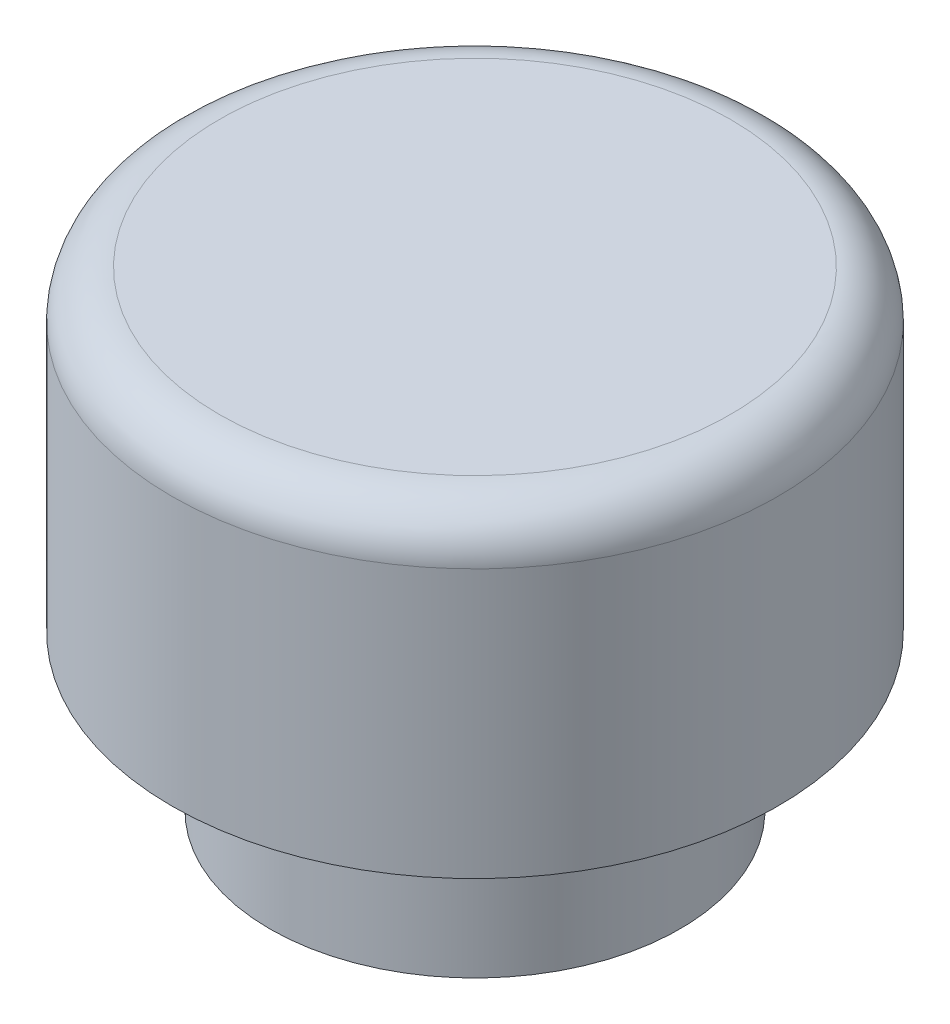
ISO-10303-21;
HEADER;
FILE_DESCRIPTION(('STEP AP214'),'2;1');
FILE_NAME('part.step','',(''),(''),'','','');
FILE_SCHEMA(('AUTOMOTIVE_DESIGN { 1 0 10303 214 1 1 1 1 }'));
ENDSEC;
DATA;
#1=APPLICATION_CONTEXT('core data for automotive mechanical design processes');
#2=APPLICATION_PROTOCOL_DEFINITION('international standard','automotive_design',2000,#1);
#3=PRODUCT_CONTEXT('',#1,'mechanical');
#4=PRODUCT('Part','Part','',(#3));
#5=PRODUCT_RELATED_PRODUCT_CATEGORY('part','',(#4));
#6=PRODUCT_DEFINITION_FORMATION('','',#4);
#7=PRODUCT_DEFINITION_CONTEXT('part definition',#1,'design');
#8=PRODUCT_DEFINITION('design','',#6,#7);
#9=PRODUCT_DEFINITION_SHAPE('','',#8);
#10=(LENGTH_UNIT() NAMED_UNIT(*) SI_UNIT(.MILLI.,.METRE.));
#11=(NAMED_UNIT(*) PLANE_ANGLE_UNIT() SI_UNIT($,.RADIAN.));
#12=(NAMED_UNIT(*) SI_UNIT($,.STERADIAN.) SOLID_ANGLE_UNIT());
#13=UNCERTAINTY_MEASURE_WITH_UNIT(LENGTH_MEASURE(1.E-05),#10,'distance_accuracy_value','');
#14=(GEOMETRIC_REPRESENTATION_CONTEXT(3) GLOBAL_UNCERTAINTY_ASSIGNED_CONTEXT((#13)) GLOBAL_UNIT_ASSIGNED_CONTEXT((#10,
#11,#12)) REPRESENTATION_CONTEXT('',''));
#15=CARTESIAN_POINT('',(0.,0.,0.));
#16=DIRECTION('',(0.,0.,1.));
#17=DIRECTION('',(1.,0.,0.));
#18=AXIS2_PLACEMENT_3D('',#15,#16,#17);
#19=CARTESIAN_POINT('',(0.,2.46,0.));
#20=DIRECTION('',(0.,-1.,0.));
#21=DIRECTION('',(0.,0.,-1.));
#22=AXIS2_PLACEMENT_3D('',#19,#20,#21);
#23=CYLINDRICAL_SURFACE('',#22,3.25);
#24=CARTESIAN_POINT('',(0.,2.46,0.));
#25=DIRECTION('',(0.,1.,0.));
#26=DIRECTION('',(0.,0.,1.));
#27=AXIS2_PLACEMENT_3D('',#24,#25,#26);
#28=CIRCLE('',#27,3.25);
#29=CARTESIAN_POINT('',(0.,2.46,3.25));
#30=VERTEX_POINT('',#29);
#31=EDGE_CURVE('E93',#30,#30,#28,.T.);
#32=ORIENTED_EDGE('',*,*,#31,.F.);
#33=EDGE_LOOP('',(#32));
#34=FACE_BOUND('',#33,.T.);
#35=CARTESIAN_POINT('',(0.,0.,0.));
#36=DIRECTION('',(0.,1.,0.));
#37=DIRECTION('',(0.,0.,1.));
#38=AXIS2_PLACEMENT_3D('',#35,#36,#37);
#39=CIRCLE('',#38,3.25);
#40=CARTESIAN_POINT('',(0.,0.,3.25));
#41=VERTEX_POINT('',#40);
#42=EDGE_CURVE('E98',#41,#41,#39,.T.);
#43=ORIENTED_EDGE('',*,*,#42,.T.);
#44=EDGE_LOOP('',(#43));
#45=FACE_BOUND('',#44,.T.);
#46=ADVANCED_FACE('F80',(#34,#45),#23,.T.);
#47=CARTESIAN_POINT('',(0.,0.,0.));
#48=DIRECTION('',(0.,1.,0.));
#49=DIRECTION('',(0.,0.,1.));
#50=AXIS2_PLACEMENT_3D('',#47,#48,#49);
#51=PLANE('',#50);
#52=CARTESIAN_POINT('',(0.,0.,0.));
#53=DIRECTION('',(0.,-1.,0.));
#54=DIRECTION('',(0.,0.,-1.));
#55=AXIS2_PLACEMENT_3D('',#52,#53,#54);
#56=CIRCLE('',#55,1.75);
#57=CARTESIAN_POINT('',(0.,0.,-1.75));
#58=VERTEX_POINT('',#57);
#59=EDGE_CURVE('E103',#58,#58,#56,.T.);
#60=ORIENTED_EDGE('',*,*,#59,.F.);
#61=EDGE_LOOP('',(#60));
#62=FACE_BOUND('',#61,.T.);
#63=ORIENTED_EDGE('',*,*,#42,.F.);
#64=EDGE_LOOP('',(#63));
#65=FACE_BOUND('',#64,.T.);
#66=ADVANCED_FACE('F132',(#62,#65),#51,.F.);
#67=CARTESIAN_POINT('',(0.,3.35,0.));
#68=DIRECTION('',(0.,-1.,0.));
#69=DIRECTION('',(0.,0.,-1.));
#70=AXIS2_PLACEMENT_3D('',#67,#68,#69);
#71=CYLINDRICAL_SURFACE('',#70,1.75);
#72=CARTESIAN_POINT('',(0.,2.46,0.));
#73=DIRECTION('',(0.,1.,0.));
#74=DIRECTION('',(0.,0.,1.));
#75=AXIS2_PLACEMENT_3D('',#72,#73,#74);
#76=CIRCLE('',#75,1.75);
#77=CARTESIAN_POINT('',(0.,2.46,1.75));
#78=VERTEX_POINT('',#77);
#79=EDGE_CURVE('E105',#78,#78,#76,.T.);
#80=ORIENTED_EDGE('',*,*,#79,.T.);
#81=EDGE_LOOP('',(#80));
#82=FACE_BOUND('',#81,.T.);
#83=ORIENTED_EDGE('',*,*,#59,.T.);
#84=EDGE_LOOP('',(#83));
#85=FACE_BOUND('',#84,.T.);
#86=ADVANCED_FACE('F122',(#82,#85),#71,.F.);
#87=CARTESIAN_POINT('',(0.,2.46,0.));
#88=DIRECTION('',(0.,1.,0.));
#89=DIRECTION('',(0.,0.,1.));
#90=AXIS2_PLACEMENT_3D('',#87,#88,#89);
#91=PLANE('',#90);
#92=ORIENTED_EDGE('',*,*,#31,.T.);
#93=EDGE_LOOP('',(#92));
#94=FACE_BOUND('',#93,.T.);
#95=CARTESIAN_POINT('',(0.,2.46,0.));
#96=DIRECTION('',(0.,1.,0.));
#97=DIRECTION('',(0.,0.,1.));
#98=AXIS2_PLACEMENT_3D('',#95,#96,#97);
#99=CIRCLE('',#98,4.8);
#100=CARTESIAN_POINT('',(0.,2.46,4.8));
#101=VERTEX_POINT('',#100);
#102=EDGE_CURVE('E109',#101,#101,#99,.T.);
#103=ORIENTED_EDGE('',*,*,#102,.F.);
#104=EDGE_LOOP('',(#103));
#105=FACE_BOUND('',#104,.T.);
#106=ADVANCED_FACE('F119',(#94,#105),#91,.F.);
#107=CARTESIAN_POINT('',(0.,7.46,0.));
#108=DIRECTION('',(0.,1.,0.));
#109=DIRECTION('',(0.,0.,1.));
#110=AXIS2_PLACEMENT_3D('',#107,#108,#109);
#111=PLANE('',#110);
#112=CARTESIAN_POINT('',(0.,7.46,0.));
#113=DIRECTION('',(0.,1.,0.));
#114=DIRECTION('',(0.,0.,1.));
#115=AXIS2_PLACEMENT_3D('',#112,#113,#114);
#116=CIRCLE('',#115,4.05);
#117=CARTESIAN_POINT('',(0.,7.46,4.05));
#118=VERTEX_POINT('',#117);
#119=EDGE_CURVE('E88',#118,#118,#116,.T.);
#120=ORIENTED_EDGE('',*,*,#119,.T.);
#121=EDGE_LOOP('',(#120));
#122=FACE_BOUND('',#121,.T.);
#123=ADVANCED_FACE('F121',(#122),#111,.T.);
#124=CARTESIAN_POINT('',(0.,7.46,0.));
#125=DIRECTION('',(0.,-1.,0.));
#126=DIRECTION('',(0.,0.,-1.));
#127=AXIS2_PLACEMENT_3D('',#124,#125,#126);
#128=CYLINDRICAL_SURFACE('',#127,4.8);
#129=CARTESIAN_POINT('',(0.,6.71,0.));
#130=DIRECTION('',(0.,1.,0.));
#131=DIRECTION('',(0.,0.,1.));
#132=AXIS2_PLACEMENT_3D('',#129,#130,#131);
#133=CIRCLE('',#132,4.8);
#134=CARTESIAN_POINT('',(0.,6.71,4.8));
#135=VERTEX_POINT('',#134);
#136=EDGE_CURVE('E11',#135,#135,#133,.F.);
#137=ORIENTED_EDGE('',*,*,#136,.T.);
#138=EDGE_LOOP('',(#137));
#139=FACE_BOUND('',#138,.T.);
#140=ORIENTED_EDGE('',*,*,#102,.T.);
#141=EDGE_LOOP('',(#140));
#142=FACE_BOUND('',#141,.T.);
#143=ADVANCED_FACE('F117',(#139,#142),#128,.T.);
#144=ORIENTED_EDGE('',*,*,#79,.F.);
#145=EDGE_LOOP('',(#144));
#146=FACE_BOUND('',#145,.T.);
#147=ADVANCED_FACE('F125',(#146),#91,.F.);
#148=CARTESIAN_POINT('',(0.,6.71,0.));
#149=DIRECTION('',(0.,1.,0.));
#150=DIRECTION('',(0.,0.,1.));
#151=AXIS2_PLACEMENT_3D('',#148,#149,#150);
#152=TOROIDAL_SURFACE('',#151,4.05,0.75);
#153=ORIENTED_EDGE('',*,*,#136,.F.);
#154=EDGE_LOOP('',(#153));
#155=FACE_BOUND('',#154,.T.);
#156=ORIENTED_EDGE('',*,*,#119,.F.);
#157=EDGE_LOOP('',(#156));
#158=FACE_BOUND('',#157,.T.);
#159=ADVANCED_FACE('F82',(#155,#158),#152,.T.);
#160=CLOSED_SHELL('',(#46,#66,#86,#106,#123,#143,#147,#159));
#161=MANIFOLD_SOLID_BREP('B2',#160);
#162=ADVANCED_BREP_SHAPE_REPRESENTATION('',(#18,#161),#14);
#163=SHAPE_DEFINITION_REPRESENTATION(#9,#162);
ENDSEC;
END-ISO-10303-21;
